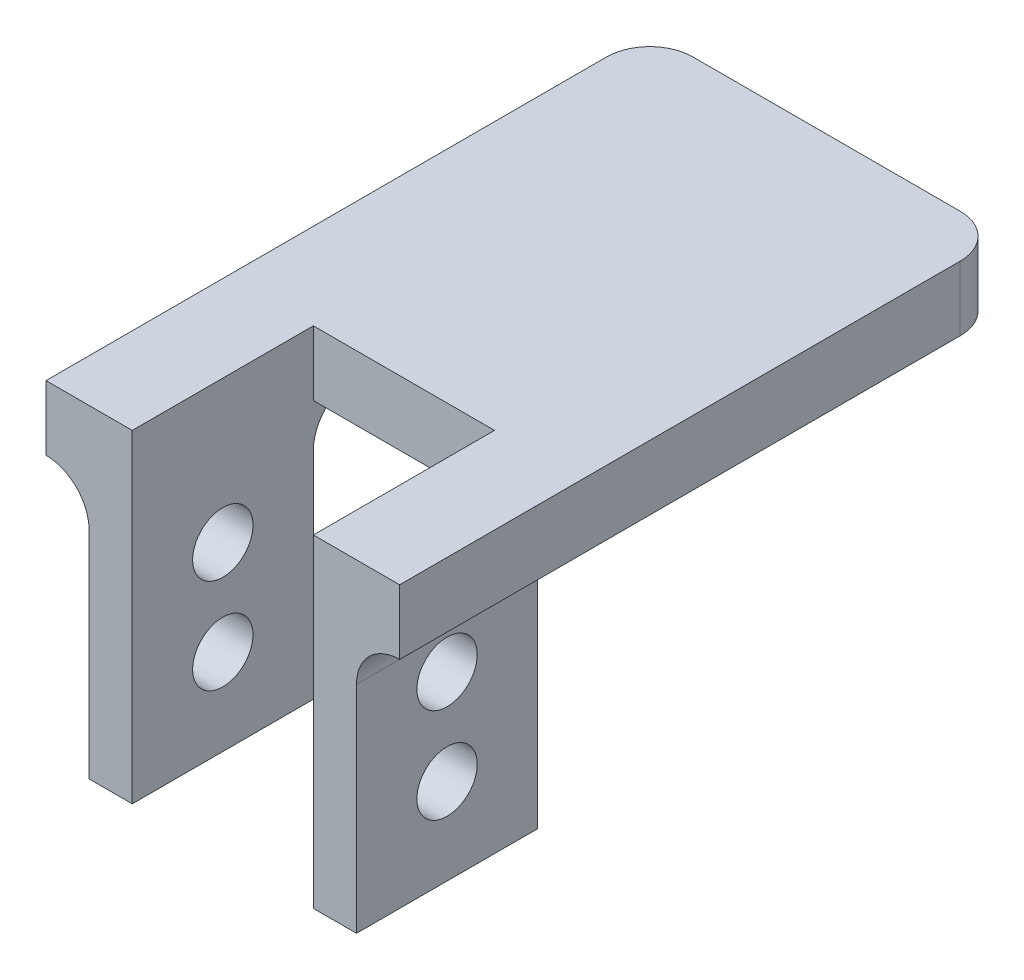
ISO-10303-21;
HEADER;
FILE_DESCRIPTION(('STEP AP214'),'2;1');
FILE_NAME('part.step','',(''),(''),'','','');
FILE_SCHEMA(('AUTOMOTIVE_DESIGN { 1 0 10303 214 1 1 1 1 }'));
ENDSEC;
DATA;
#1=APPLICATION_CONTEXT('core data for automotive mechanical design processes');
#2=APPLICATION_PROTOCOL_DEFINITION('international standard','automotive_design',2000,#1);
#3=PRODUCT_CONTEXT('',#1,'mechanical');
#4=PRODUCT('Part','Part','',(#3));
#5=PRODUCT_RELATED_PRODUCT_CATEGORY('part','',(#4));
#6=PRODUCT_DEFINITION_FORMATION('','',#4);
#7=PRODUCT_DEFINITION_CONTEXT('part definition',#1,'design');
#8=PRODUCT_DEFINITION('design','',#6,#7);
#9=PRODUCT_DEFINITION_SHAPE('','',#8);
#10=(LENGTH_UNIT() NAMED_UNIT(*) SI_UNIT(.MILLI.,.METRE.));
#11=(NAMED_UNIT(*) PLANE_ANGLE_UNIT() SI_UNIT($,.RADIAN.));
#12=(NAMED_UNIT(*) SI_UNIT($,.STERADIAN.) SOLID_ANGLE_UNIT());
#13=UNCERTAINTY_MEASURE_WITH_UNIT(LENGTH_MEASURE(1.E-05),#10,'distance_accuracy_value','');
#14=(GEOMETRIC_REPRESENTATION_CONTEXT(3) GLOBAL_UNCERTAINTY_ASSIGNED_CONTEXT((#13)) GLOBAL_UNIT_ASSIGNED_CONTEXT((#10,
#11,#12)) REPRESENTATION_CONTEXT('',''));
#15=CARTESIAN_POINT('',(0.,0.,0.));
#16=DIRECTION('',(0.,0.,1.));
#17=DIRECTION('',(1.,0.,0.));
#18=AXIS2_PLACEMENT_3D('',#15,#16,#17);
#19=CARTESIAN_POINT('',(0.,0.,0.));
#20=DIRECTION('',(0.,1.,0.));
#21=DIRECTION('',(0.,0.,1.));
#22=AXIS2_PLACEMENT_3D('',#19,#20,#21);
#23=PLANE('',#22);
#24=DIRECTION('',(0.,0.,1.));
#25=VECTOR('',#24,1.);
#26=CARTESIAN_POINT('',(-20.5,0.,-59.5));
#27=LINE('',#26,#25);
#28=CARTESIAN_POINT('',(-20.5,0.,-54.5));
#29=VERTEX_POINT('',#28);
#30=CARTESIAN_POINT('',(-20.5,0.,-15.5));
#31=VERTEX_POINT('',#30);
#32=EDGE_CURVE('E206',#29,#31,#27,.T.);
#33=ORIENTED_EDGE('',*,*,#32,.F.);
#34=CARTESIAN_POINT('',(-15.5,0.,-54.5));
#35=DIRECTION('',(0.,1.,0.));
#36=DIRECTION('',(0.,0.,1.));
#37=AXIS2_PLACEMENT_3D('',#34,#35,#36);
#38=CIRCLE('',#37,5.);
#39=CARTESIAN_POINT('',(-15.5,0.,-59.5));
#40=VERTEX_POINT('',#39);
#41=EDGE_CURVE('E327',#29,#40,#38,.F.);
#42=ORIENTED_EDGE('',*,*,#41,.T.);
#43=DIRECTION('',(-1.,0.,0.));
#44=VECTOR('',#43,1.);
#45=CARTESIAN_POINT('',(20.5,0.,-59.5));
#46=LINE('',#45,#44);
#47=CARTESIAN_POINT('',(15.5,0.,-59.5));
#48=VERTEX_POINT('',#47);
#49=EDGE_CURVE('E241',#48,#40,#46,.T.);
#50=ORIENTED_EDGE('',*,*,#49,.F.);
#51=CARTESIAN_POINT('',(15.5,0.,-54.5));
#52=DIRECTION('',(0.,1.,0.));
#53=DIRECTION('',(0.,0.,1.));
#54=AXIS2_PLACEMENT_3D('',#51,#52,#53);
#55=CIRCLE('',#54,5.);
#56=CARTESIAN_POINT('',(20.5,0.,-54.5));
#57=VERTEX_POINT('',#56);
#58=EDGE_CURVE('E324',#48,#57,#55,.F.);
#59=ORIENTED_EDGE('',*,*,#58,.T.);
#60=DIRECTION('',(0.,0.,-1.));
#61=VECTOR('',#60,1.);
#62=CARTESIAN_POINT('',(20.5,0.,10.5));
#63=LINE('',#62,#61);
#64=CARTESIAN_POINT('',(20.5,0.,-15.5));
#65=VERTEX_POINT('',#64);
#66=EDGE_CURVE('E269',#65,#57,#63,.T.);
#67=ORIENTED_EDGE('',*,*,#66,.F.);
#68=DIRECTION('',(1.,0.,0.));
#69=VECTOR('',#68,1.);
#70=CARTESIAN_POINT('',(10.5,0.,-15.5));
#71=LINE('',#70,#69);
#72=CARTESIAN_POINT('',(10.5,0.,-15.5));
#73=VERTEX_POINT('',#72);
#74=EDGE_CURVE('E315',#65,#73,#71,.F.);
#75=ORIENTED_EDGE('',*,*,#74,.T.);
#76=DIRECTION('',(0.,0.,1.));
#77=VECTOR('',#76,1.);
#78=CARTESIAN_POINT('',(10.5,0.,-10.5));
#79=LINE('',#78,#77);
#80=CARTESIAN_POINT('',(10.5,0.,-10.5));
#81=VERTEX_POINT('',#80);
#82=EDGE_CURVE('E312',#73,#81,#79,.T.);
#83=ORIENTED_EDGE('',*,*,#82,.T.);
#84=DIRECTION('',(1.,0.,0.));
#85=VECTOR('',#84,1.);
#86=CARTESIAN_POINT('',(-10.5,0.,-10.5));
#87=LINE('',#86,#85);
#88=CARTESIAN_POINT('',(-10.5,0.,-10.5));
#89=VERTEX_POINT('',#88);
#90=EDGE_CURVE('E265',#89,#81,#87,.T.);
#91=ORIENTED_EDGE('',*,*,#90,.F.);
#92=DIRECTION('',(0.,0.,-1.));
#93=VECTOR('',#92,1.);
#94=CARTESIAN_POINT('',(-10.5,0.,10.5));
#95=LINE('',#94,#93);
#96=CARTESIAN_POINT('',(-10.5,0.,-15.5));
#97=VERTEX_POINT('',#96);
#98=EDGE_CURVE('E63',#89,#97,#95,.T.);
#99=ORIENTED_EDGE('',*,*,#98,.T.);
#100=DIRECTION('',(1.,0.,0.));
#101=VECTOR('',#100,1.);
#102=CARTESIAN_POINT('',(-15.5,0.,-15.5));
#103=LINE('',#102,#101);
#104=EDGE_CURVE('E319',#97,#31,#103,.F.);
#105=ORIENTED_EDGE('',*,*,#104,.T.);
#106=EDGE_LOOP('',(#33,#42,#50,#59,#67,#75,#83,#91,#99,#105));
#107=FACE_BOUND('',#106,.T.);
#108=ADVANCED_FACE('F45',(#107),#23,.F.);
#109=CARTESIAN_POINT('',(-20.5,7.5,-59.5));
#110=DIRECTION('',(1.,0.,0.));
#111=DIRECTION('',(0.,0.,-1.));
#112=AXIS2_PLACEMENT_3D('',#109,#110,#111);
#113=PLANE('',#112);
#114=DIRECTION('',(0.,0.,1.));
#115=VECTOR('',#114,1.);
#116=CARTESIAN_POINT('',(-20.5,7.5,-59.5));
#117=LINE('',#116,#115);
#118=CARTESIAN_POINT('',(-20.5,7.5,-54.5));
#119=VERTEX_POINT('',#118);
#120=CARTESIAN_POINT('',(-20.5,7.5,10.5));
#121=VERTEX_POINT('',#120);
#122=EDGE_CURVE('E237',#119,#121,#117,.T.);
#123=ORIENTED_EDGE('',*,*,#122,.F.);
#124=DIRECTION('',(0.,-1.,0.));
#125=VECTOR('',#124,1.);
#126=CARTESIAN_POINT('',(-20.5,7.5,-54.5));
#127=LINE('',#126,#125);
#128=EDGE_CURVE('E334',#119,#29,#127,.T.);
#129=ORIENTED_EDGE('',*,*,#128,.T.);
#130=ORIENTED_EDGE('',*,*,#32,.T.);
#131=CARTESIAN_POINT('',(-20.5,0.,10.5));
#132=VERTEX_POINT('',#131);
#133=EDGE_CURVE('E202',#31,#132,#27,.T.);
#134=ORIENTED_EDGE('',*,*,#133,.T.);
#135=DIRECTION('',(0.,-1.,0.));
#136=VECTOR('',#135,1.);
#137=CARTESIAN_POINT('',(-20.5,7.5,10.5));
#138=LINE('',#137,#136);
#139=EDGE_CURVE('E294',#121,#132,#138,.T.);
#140=ORIENTED_EDGE('',*,*,#139,.F.);
#141=EDGE_LOOP('',(#123,#129,#130,#134,#140));
#142=FACE_BOUND('',#141,.T.);
#143=ADVANCED_FACE('F423',(#142),#113,.F.);
#144=CARTESIAN_POINT('',(-20.5,7.5,10.5));
#145=DIRECTION('',(0.,0.,-1.));
#146=DIRECTION('',(-1.,0.,0.));
#147=AXIS2_PLACEMENT_3D('',#144,#145,#146);
#148=PLANE('',#147);
#149=ORIENTED_EDGE('',*,*,#139,.T.);
#150=CARTESIAN_POINT('',(-20.5,-5.,10.5));
#151=DIRECTION('',(0.,0.,-1.));
#152=DIRECTION('',(-1.,0.,0.));
#153=AXIS2_PLACEMENT_3D('',#150,#151,#152);
#154=CIRCLE('',#153,5.);
#155=CARTESIAN_POINT('',(-15.5,-5.,10.5));
#156=VERTEX_POINT('',#155);
#157=EDGE_CURVE('E360',#132,#156,#154,.T.);
#158=ORIENTED_EDGE('',*,*,#157,.T.);
#159=DIRECTION('',(0.,1.,0.));
#160=VECTOR('',#159,1.);
#161=CARTESIAN_POINT('',(-15.5,-30.,10.5));
#162=LINE('',#161,#160);
#163=CARTESIAN_POINT('',(-15.5,-30.,10.5));
#164=VERTEX_POINT('',#163);
#165=EDGE_CURVE('E208',#164,#156,#162,.T.);
#166=ORIENTED_EDGE('',*,*,#165,.F.);
#167=DIRECTION('',(-1.,0.,0.));
#168=VECTOR('',#167,1.);
#169=CARTESIAN_POINT('',(-15.5,-30.,10.5));
#170=LINE('',#169,#168);
#171=CARTESIAN_POINT('',(-10.5,-30.,10.5));
#172=VERTEX_POINT('',#171);
#173=EDGE_CURVE('E190',#172,#164,#170,.T.);
#174=ORIENTED_EDGE('',*,*,#173,.F.);
#175=DIRECTION('',(0.,-1.,0.));
#176=VECTOR('',#175,1.);
#177=CARTESIAN_POINT('',(-10.5,7.5,10.5));
#178=LINE('',#177,#176);
#179=CARTESIAN_POINT('',(-10.5,7.5,10.5));
#180=VERTEX_POINT('',#179);
#181=EDGE_CURVE('E291',#180,#172,#178,.T.);
#182=ORIENTED_EDGE('',*,*,#181,.F.);
#183=DIRECTION('',(1.,0.,0.));
#184=VECTOR('',#183,1.);
#185=CARTESIAN_POINT('',(-20.5,7.5,10.5));
#186=LINE('',#185,#184);
#187=EDGE_CURVE('E240',#121,#180,#186,.T.);
#188=ORIENTED_EDGE('',*,*,#187,.F.);
#189=EDGE_LOOP('',(#149,#158,#166,#174,#182,#188));
#190=FACE_BOUND('',#189,.T.);
#191=ADVANCED_FACE('F429',(#190),#148,.F.);
#192=CARTESIAN_POINT('',(-10.5,7.5,10.5));
#193=DIRECTION('',(-1.,0.,0.));
#194=DIRECTION('',(0.,0.,1.));
#195=AXIS2_PLACEMENT_3D('',#192,#193,#194);
#196=PLANE('',#195);
#197=CARTESIAN_POINT('',(-10.5,-8.99999999999999,0.));
#198=DIRECTION('',(-1.,0.,0.));
#199=DIRECTION('',(0.,0.,1.));
#200=AXIS2_PLACEMENT_3D('',#197,#198,#199);
#201=CIRCLE('',#200,3.5);
#202=CARTESIAN_POINT('',(-10.5,-8.99999999999999,3.5));
#203=VERTEX_POINT('',#202);
#204=EDGE_CURVE('E217',#203,#203,#201,.T.);
#205=ORIENTED_EDGE('',*,*,#204,.T.);
#206=EDGE_LOOP('',(#205));
#207=FACE_BOUND('',#206,.T.);
#208=CARTESIAN_POINT('',(-10.5,-20.,0.));
#209=DIRECTION('',(-1.,0.,0.));
#210=DIRECTION('',(0.,0.,1.));
#211=AXIS2_PLACEMENT_3D('',#208,#209,#210);
#212=CIRCLE('',#211,3.5);
#213=CARTESIAN_POINT('',(-10.5,-20.,3.5));
#214=VERTEX_POINT('',#213);
#215=EDGE_CURVE('E309',#214,#214,#212,.T.);
#216=ORIENTED_EDGE('',*,*,#215,.T.);
#217=EDGE_LOOP('',(#216));
#218=FACE_BOUND('',#217,.T.);
#219=ORIENTED_EDGE('',*,*,#181,.T.);
#220=DIRECTION('',(0.,0.,1.));
#221=VECTOR('',#220,1.);
#222=CARTESIAN_POINT('',(-10.5,-30.,10.5));
#223=LINE('',#222,#221);
#224=CARTESIAN_POINT('',(-10.5,-30.,-10.5));
#225=VERTEX_POINT('',#224);
#226=EDGE_CURVE('E184',#225,#172,#223,.T.);
#227=ORIENTED_EDGE('',*,*,#226,.F.);
#228=DIRECTION('',(0.,1.,0.));
#229=VECTOR('',#228,1.);
#230=CARTESIAN_POINT('',(-10.5,-30.,-10.5));
#231=LINE('',#230,#229);
#232=CARTESIAN_POINT('',(-10.5,-5.,-10.5));
#233=VERTEX_POINT('',#232);
#234=EDGE_CURVE('E179',#225,#233,#231,.T.);
#235=ORIENTED_EDGE('',*,*,#234,.T.);
#236=CARTESIAN_POINT('',(-10.5,-5.,-15.5));
#237=DIRECTION('',(-1.,0.,0.));
#238=DIRECTION('',(0.,0.,1.));
#239=AXIS2_PLACEMENT_3D('',#236,#237,#238);
#240=CIRCLE('',#239,5.);
#241=EDGE_CURVE('E55',#233,#97,#240,.T.);
#242=ORIENTED_EDGE('',*,*,#241,.T.);
#243=ORIENTED_EDGE('',*,*,#98,.F.);
#244=DIRECTION('',(0.,-1.,0.));
#245=VECTOR('',#244,1.);
#246=CARTESIAN_POINT('',(-10.5,7.5,-10.5));
#247=LINE('',#246,#245);
#248=CARTESIAN_POINT('',(-10.5,7.5,-10.5));
#249=VERTEX_POINT('',#248);
#250=EDGE_CURVE('E287',#249,#89,#247,.T.);
#251=ORIENTED_EDGE('',*,*,#250,.F.);
#252=DIRECTION('',(0.,0.,-1.));
#253=VECTOR('',#252,1.);
#254=CARTESIAN_POINT('',(-10.5,7.5,10.5));
#255=LINE('',#254,#253);
#256=EDGE_CURVE('E244',#180,#249,#255,.T.);
#257=ORIENTED_EDGE('',*,*,#256,.F.);
#258=EDGE_LOOP('',(#219,#227,#235,#242,#243,#251,#257));
#259=FACE_BOUND('',#258,.T.);
#260=ADVANCED_FACE('F447',(#207,#218,#259),#196,.F.);
#261=CARTESIAN_POINT('',(-10.5,7.5,-10.5));
#262=DIRECTION('',(0.,0.,-1.));
#263=DIRECTION('',(-1.,0.,0.));
#264=AXIS2_PLACEMENT_3D('',#261,#262,#263);
#265=PLANE('',#264);
#266=ORIENTED_EDGE('',*,*,#90,.T.);
#267=DIRECTION('',(0.,-1.,0.));
#268=VECTOR('',#267,1.);
#269=CARTESIAN_POINT('',(10.5,7.5,-10.5));
#270=LINE('',#269,#268);
#271=CARTESIAN_POINT('',(10.5,7.5,-10.5));
#272=VERTEX_POINT('',#271);
#273=EDGE_CURVE('E283',#272,#81,#270,.T.);
#274=ORIENTED_EDGE('',*,*,#273,.F.);
#275=DIRECTION('',(1.,0.,0.));
#276=VECTOR('',#275,1.);
#277=CARTESIAN_POINT('',(-10.5,7.5,-10.5));
#278=LINE('',#277,#276);
#279=EDGE_CURVE('E247',#249,#272,#278,.T.);
#280=ORIENTED_EDGE('',*,*,#279,.F.);
#281=ORIENTED_EDGE('',*,*,#250,.T.);
#282=EDGE_LOOP('',(#266,#274,#280,#281));
#283=FACE_BOUND('',#282,.T.);
#284=ADVANCED_FACE('F444',(#283),#265,.F.);
#285=CARTESIAN_POINT('',(10.5,7.5,-10.5));
#286=DIRECTION('',(1.,0.,0.));
#287=DIRECTION('',(0.,0.,-1.));
#288=AXIS2_PLACEMENT_3D('',#285,#286,#287);
#289=PLANE('',#288);
#290=CARTESIAN_POINT('',(10.5,-8.99999999999999,0.));
#291=DIRECTION('',(1.,0.,0.));
#292=DIRECTION('',(0.,0.,-1.));
#293=AXIS2_PLACEMENT_3D('',#290,#291,#292);
#294=CIRCLE('',#293,3.5);
#295=CARTESIAN_POINT('',(10.5,-8.99999999999999,-3.5));
#296=VERTEX_POINT('',#295);
#297=EDGE_CURVE('E501',#296,#296,#294,.T.);
#298=ORIENTED_EDGE('',*,*,#297,.T.);
#299=EDGE_LOOP('',(#298));
#300=FACE_BOUND('',#299,.T.);
#301=CARTESIAN_POINT('',(10.5,-20.,0.));
#302=DIRECTION('',(1.,0.,0.));
#303=DIRECTION('',(0.,0.,-1.));
#304=AXIS2_PLACEMENT_3D('',#301,#302,#303);
#305=CIRCLE('',#304,3.5);
#306=CARTESIAN_POINT('',(10.5,-20.,-3.5));
#307=VERTEX_POINT('',#306);
#308=EDGE_CURVE('E511',#307,#307,#305,.T.);
#309=ORIENTED_EDGE('',*,*,#308,.T.);
#310=EDGE_LOOP('',(#309));
#311=FACE_BOUND('',#310,.T.);
#312=ORIENTED_EDGE('',*,*,#273,.T.);
#313=ORIENTED_EDGE('',*,*,#82,.F.);
#314=CARTESIAN_POINT('',(10.5,-5.,-15.5));
#315=DIRECTION('',(1.,0.,0.));
#316=DIRECTION('',(0.,0.,-1.));
#317=AXIS2_PLACEMENT_3D('',#314,#315,#316);
#318=CIRCLE('',#317,5.);
#319=CARTESIAN_POINT('',(10.5,-5.,-10.5));
#320=VERTEX_POINT('',#319);
#321=EDGE_CURVE('E11',#73,#320,#318,.T.);
#322=ORIENTED_EDGE('',*,*,#321,.T.);
#323=DIRECTION('',(0.,1.,0.));
#324=VECTOR('',#323,1.);
#325=CARTESIAN_POINT('',(10.5,-30.,-10.5));
#326=LINE('',#325,#324);
#327=CARTESIAN_POINT('',(10.5,-30.,-10.5));
#328=VERTEX_POINT('',#327);
#329=EDGE_CURVE('E216',#328,#320,#326,.T.);
#330=ORIENTED_EDGE('',*,*,#329,.F.);
#331=DIRECTION('',(0.,0.,-1.));
#332=VECTOR('',#331,1.);
#333=CARTESIAN_POINT('',(10.5,-30.,10.5));
#334=LINE('',#333,#332);
#335=CARTESIAN_POINT('',(10.5,-30.,10.5));
#336=VERTEX_POINT('',#335);
#337=EDGE_CURVE('E227',#336,#328,#334,.T.);
#338=ORIENTED_EDGE('',*,*,#337,.F.);
#339=DIRECTION('',(0.,-1.,0.));
#340=VECTOR('',#339,1.);
#341=CARTESIAN_POINT('',(10.5,7.5,10.5));
#342=LINE('',#341,#340);
#343=CARTESIAN_POINT('',(10.5,7.5,10.5));
#344=VERTEX_POINT('',#343);
#345=EDGE_CURVE('E280',#344,#336,#342,.T.);
#346=ORIENTED_EDGE('',*,*,#345,.F.);
#347=DIRECTION('',(0.,0.,1.));
#348=VECTOR('',#347,1.);
#349=CARTESIAN_POINT('',(10.5,7.5,-10.5));
#350=LINE('',#349,#348);
#351=EDGE_CURVE('E250',#272,#344,#350,.T.);
#352=ORIENTED_EDGE('',*,*,#351,.F.);
#353=EDGE_LOOP('',(#312,#313,#322,#330,#338,#346,#352));
#354=FACE_BOUND('',#353,.T.);
#355=ADVANCED_FACE('F405',(#300,#311,#354),#289,.F.);
#356=CARTESIAN_POINT('',(10.5,7.5,10.5));
#357=DIRECTION('',(0.,0.,-1.));
#358=DIRECTION('',(-1.,0.,0.));
#359=AXIS2_PLACEMENT_3D('',#356,#357,#358);
#360=PLANE('',#359);
#361=ORIENTED_EDGE('',*,*,#345,.T.);
#362=DIRECTION('',(-1.,0.,0.));
#363=VECTOR('',#362,1.);
#364=CARTESIAN_POINT('',(15.5,-30.,10.5));
#365=LINE('',#364,#363);
#366=CARTESIAN_POINT('',(15.5,-30.,10.5));
#367=VERTEX_POINT('',#366);
#368=EDGE_CURVE('E230',#367,#336,#365,.T.);
#369=ORIENTED_EDGE('',*,*,#368,.F.);
#370=DIRECTION('',(0.,1.,0.));
#371=VECTOR('',#370,1.);
#372=CARTESIAN_POINT('',(15.5,-30.,10.5));
#373=LINE('',#372,#371);
#374=CARTESIAN_POINT('',(15.5,-5.,10.5));
#375=VERTEX_POINT('',#374);
#376=EDGE_CURVE('E212',#367,#375,#373,.T.);
#377=ORIENTED_EDGE('',*,*,#376,.T.);
#378=CARTESIAN_POINT('',(20.5,-5.,10.5));
#379=DIRECTION('',(0.,0.,-1.));
#380=DIRECTION('',(-1.,0.,0.));
#381=AXIS2_PLACEMENT_3D('',#378,#379,#380);
#382=CIRCLE('',#381,5.);
#383=CARTESIAN_POINT('',(20.5,0.,10.5));
#384=VERTEX_POINT('',#383);
#385=EDGE_CURVE('E363',#375,#384,#382,.T.);
#386=ORIENTED_EDGE('',*,*,#385,.T.);
#387=DIRECTION('',(0.,-1.,0.));
#388=VECTOR('',#387,1.);
#389=CARTESIAN_POINT('',(20.5,7.5,10.5));
#390=LINE('',#389,#388);
#391=CARTESIAN_POINT('',(20.5,7.5,10.5));
#392=VERTEX_POINT('',#391);
#393=EDGE_CURVE('E263',#392,#384,#390,.T.);
#394=ORIENTED_EDGE('',*,*,#393,.F.);
#395=DIRECTION('',(1.,0.,0.));
#396=VECTOR('',#395,1.);
#397=CARTESIAN_POINT('',(10.5,7.5,10.5));
#398=LINE('',#397,#396);
#399=EDGE_CURVE('E253',#344,#392,#398,.T.);
#400=ORIENTED_EDGE('',*,*,#399,.F.);
#401=EDGE_LOOP('',(#361,#369,#377,#386,#394,#400));
#402=FACE_BOUND('',#401,.T.);
#403=ADVANCED_FACE('F395',(#402),#360,.F.);
#404=CARTESIAN_POINT('',(20.5,7.5,10.5));
#405=DIRECTION('',(-1.,0.,0.));
#406=DIRECTION('',(0.,0.,1.));
#407=AXIS2_PLACEMENT_3D('',#404,#405,#406);
#408=PLANE('',#407);
#409=ORIENTED_EDGE('',*,*,#66,.T.);
#410=DIRECTION('',(0.,-1.,0.));
#411=VECTOR('',#410,1.);
#412=CARTESIAN_POINT('',(20.5,7.5,-54.5));
#413=LINE('',#412,#411);
#414=CARTESIAN_POINT('',(20.5,7.5,-54.5));
#415=VERTEX_POINT('',#414);
#416=EDGE_CURVE('E351',#57,#415,#413,.F.);
#417=ORIENTED_EDGE('',*,*,#416,.T.);
#418=DIRECTION('',(0.,0.,-1.));
#419=VECTOR('',#418,1.);
#420=CARTESIAN_POINT('',(20.5,7.5,10.5));
#421=LINE('',#420,#419);
#422=EDGE_CURVE('E256',#392,#415,#421,.T.);
#423=ORIENTED_EDGE('',*,*,#422,.F.);
#424=ORIENTED_EDGE('',*,*,#393,.T.);
#425=EDGE_CURVE('E270',#384,#65,#63,.T.);
#426=ORIENTED_EDGE('',*,*,#425,.T.);
#427=EDGE_LOOP('',(#409,#417,#423,#424,#426));
#428=FACE_BOUND('',#427,.T.);
#429=ADVANCED_FACE('F390',(#428),#408,.F.);
#430=CARTESIAN_POINT('',(20.5,7.5,-59.5));
#431=DIRECTION('',(0.,0.,1.));
#432=DIRECTION('',(1.,0.,0.));
#433=AXIS2_PLACEMENT_3D('',#430,#431,#432);
#434=PLANE('',#433);
#435=ORIENTED_EDGE('',*,*,#49,.T.);
#436=DIRECTION('',(0.,-1.,0.));
#437=VECTOR('',#436,1.);
#438=CARTESIAN_POINT('',(-15.5,7.5,-59.5));
#439=LINE('',#438,#437);
#440=CARTESIAN_POINT('',(-15.5,7.5,-59.5));
#441=VERTEX_POINT('',#440);
#442=EDGE_CURVE('E342',#40,#441,#439,.F.);
#443=ORIENTED_EDGE('',*,*,#442,.T.);
#444=DIRECTION('',(-1.,0.,0.));
#445=VECTOR('',#444,1.);
#446=CARTESIAN_POINT('',(20.5,7.5,-59.5));
#447=LINE('',#446,#445);
#448=CARTESIAN_POINT('',(15.5,7.5,-59.5));
#449=VERTEX_POINT('',#448);
#450=EDGE_CURVE('E260',#449,#441,#447,.T.);
#451=ORIENTED_EDGE('',*,*,#450,.F.);
#452=DIRECTION('',(0.,-1.,0.));
#453=VECTOR('',#452,1.);
#454=CARTESIAN_POINT('',(15.5,7.5,-59.5));
#455=LINE('',#454,#453);
#456=EDGE_CURVE('E338',#449,#48,#455,.T.);
#457=ORIENTED_EDGE('',*,*,#456,.T.);
#458=EDGE_LOOP('',(#435,#443,#451,#457));
#459=FACE_BOUND('',#458,.T.);
#460=ADVANCED_FACE('F434',(#459),#434,.F.);
#461=CARTESIAN_POINT('',(0.,7.5,0.));
#462=DIRECTION('',(0.,1.,0.));
#463=DIRECTION('',(0.,0.,1.));
#464=AXIS2_PLACEMENT_3D('',#461,#462,#463);
#465=PLANE('',#464);
#466=ORIENTED_EDGE('',*,*,#450,.T.);
#467=CARTESIAN_POINT('',(-15.5,7.5,-54.5));
#468=DIRECTION('',(0.,1.,0.));
#469=DIRECTION('',(0.,0.,1.));
#470=AXIS2_PLACEMENT_3D('',#467,#468,#469);
#471=CIRCLE('',#470,5.);
#472=EDGE_CURVE('E348',#441,#119,#471,.T.);
#473=ORIENTED_EDGE('',*,*,#472,.T.);
#474=ORIENTED_EDGE('',*,*,#122,.T.);
#475=ORIENTED_EDGE('',*,*,#187,.T.);
#476=ORIENTED_EDGE('',*,*,#256,.T.);
#477=ORIENTED_EDGE('',*,*,#279,.T.);
#478=ORIENTED_EDGE('',*,*,#351,.T.);
#479=ORIENTED_EDGE('',*,*,#399,.T.);
#480=ORIENTED_EDGE('',*,*,#422,.T.);
#481=CARTESIAN_POINT('',(15.5,7.5,-54.5));
#482=DIRECTION('',(0.,1.,0.));
#483=DIRECTION('',(0.,0.,1.));
#484=AXIS2_PLACEMENT_3D('',#481,#482,#483);
#485=CIRCLE('',#484,5.);
#486=EDGE_CURVE('E345',#415,#449,#485,.T.);
#487=ORIENTED_EDGE('',*,*,#486,.T.);
#488=EDGE_LOOP('',(#466,#473,#474,#475,#476,#477,#478,#479,#480,#487));
#489=FACE_BOUND('',#488,.T.);
#490=ADVANCED_FACE('F433',(#489),#465,.T.);
#491=CARTESIAN_POINT('',(15.5,-30.,10.5));
#492=DIRECTION('',(-1.,0.,0.));
#493=DIRECTION('',(0.,0.,1.));
#494=AXIS2_PLACEMENT_3D('',#491,#492,#493);
#495=PLANE('',#494);
#496=CARTESIAN_POINT('',(15.5,-8.99999999999999,0.));
#497=DIRECTION('',(-1.,0.,0.));
#498=DIRECTION('',(0.,0.,1.));
#499=AXIS2_PLACEMENT_3D('',#496,#497,#498);
#500=CIRCLE('',#499,3.5);
#501=CARTESIAN_POINT('',(15.5,-8.99999999999999,3.5));
#502=VERTEX_POINT('',#501);
#503=EDGE_CURVE('E308',#502,#502,#500,.T.);
#504=ORIENTED_EDGE('',*,*,#503,.T.);
#505=EDGE_LOOP('',(#504));
#506=FACE_BOUND('',#505,.T.);
#507=CARTESIAN_POINT('',(15.5,-20.,0.));
#508=DIRECTION('',(-1.,0.,0.));
#509=DIRECTION('',(0.,0.,1.));
#510=AXIS2_PLACEMENT_3D('',#507,#508,#509);
#511=CIRCLE('',#510,3.5);
#512=CARTESIAN_POINT('',(15.5,-20.,3.5));
#513=VERTEX_POINT('',#512);
#514=EDGE_CURVE('E302',#513,#513,#511,.T.);
#515=ORIENTED_EDGE('',*,*,#514,.T.);
#516=EDGE_LOOP('',(#515));
#517=FACE_BOUND('',#516,.T.);
#518=DIRECTION('',(0.,1.,0.));
#519=VECTOR('',#518,1.);
#520=CARTESIAN_POINT('',(15.5,-30.,-10.5));
#521=LINE('',#520,#519);
#522=CARTESIAN_POINT('',(15.5,-30.,-10.5));
#523=VERTEX_POINT('',#522);
#524=CARTESIAN_POINT('',(15.5,-5.,-10.5));
#525=VERTEX_POINT('',#524);
#526=EDGE_CURVE('E220',#523,#525,#521,.T.);
#527=ORIENTED_EDGE('',*,*,#526,.T.);
#528=DIRECTION('',(0.,0.,1.));
#529=VECTOR('',#528,1.);
#530=CARTESIAN_POINT('',(15.5,-5.,10.5));
#531=LINE('',#530,#529);
#532=EDGE_CURVE('E330',#525,#375,#531,.T.);
#533=ORIENTED_EDGE('',*,*,#532,.T.);
#534=ORIENTED_EDGE('',*,*,#376,.F.);
#535=DIRECTION('',(0.,0.,1.));
#536=VECTOR('',#535,1.);
#537=CARTESIAN_POINT('',(15.5,-30.,10.5));
#538=LINE('',#537,#536);
#539=EDGE_CURVE('E195',#523,#367,#538,.T.);
#540=ORIENTED_EDGE('',*,*,#539,.F.);
#541=EDGE_LOOP('',(#527,#533,#534,#540));
#542=FACE_BOUND('',#541,.T.);
#543=ADVANCED_FACE('F398',(#506,#517,#542),#495,.F.);
#544=CARTESIAN_POINT('',(15.5,-30.,-10.5));
#545=DIRECTION('',(0.,0.,1.));
#546=DIRECTION('',(1.,0.,0.));
#547=AXIS2_PLACEMENT_3D('',#544,#545,#546);
#548=PLANE('',#547);
#549=ORIENTED_EDGE('',*,*,#329,.T.);
#550=DIRECTION('',(1.,0.,0.));
#551=VECTOR('',#550,1.);
#552=CARTESIAN_POINT('',(15.5,-5.,-10.5));
#553=LINE('',#552,#551);
#554=EDGE_CURVE('E357',#320,#525,#553,.T.);
#555=ORIENTED_EDGE('',*,*,#554,.T.);
#556=ORIENTED_EDGE('',*,*,#526,.F.);
#557=DIRECTION('',(1.,0.,0.));
#558=VECTOR('',#557,1.);
#559=CARTESIAN_POINT('',(15.5,-30.,-10.5));
#560=LINE('',#559,#558);
#561=EDGE_CURVE('E224',#328,#523,#560,.T.);
#562=ORIENTED_EDGE('',*,*,#561,.F.);
#563=EDGE_LOOP('',(#549,#555,#556,#562));
#564=FACE_BOUND('',#563,.T.);
#565=ADVANCED_FACE('F403',(#564),#548,.F.);
#566=CARTESIAN_POINT('',(0.,-30.,0.));
#567=DIRECTION('',(0.,1.,0.));
#568=DIRECTION('',(0.,0.,1.));
#569=AXIS2_PLACEMENT_3D('',#566,#567,#568);
#570=PLANE('',#569);
#571=ORIENTED_EDGE('',*,*,#539,.T.);
#572=ORIENTED_EDGE('',*,*,#368,.T.);
#573=ORIENTED_EDGE('',*,*,#337,.T.);
#574=ORIENTED_EDGE('',*,*,#561,.T.);
#575=EDGE_LOOP('',(#571,#572,#573,#574));
#576=FACE_BOUND('',#575,.T.);
#577=ADVANCED_FACE('F409',(#576),#570,.F.);
#578=CARTESIAN_POINT('',(-15.5,-30.,10.5));
#579=DIRECTION('',(1.,0.,0.));
#580=DIRECTION('',(0.,0.,-1.));
#581=AXIS2_PLACEMENT_3D('',#578,#579,#580);
#582=PLANE('',#581);
#583=CARTESIAN_POINT('',(-15.5,-8.99999999999999,0.));
#584=DIRECTION('',(1.,0.,0.));
#585=DIRECTION('',(0.,0.,-1.));
#586=AXIS2_PLACEMENT_3D('',#583,#584,#585);
#587=CIRCLE('',#586,3.5);
#588=CARTESIAN_POINT('',(-15.5,-8.99999999999999,-3.5));
#589=VERTEX_POINT('',#588);
#590=EDGE_CURVE('E304',#589,#589,#587,.T.);
#591=ORIENTED_EDGE('',*,*,#590,.T.);
#592=EDGE_LOOP('',(#591));
#593=FACE_BOUND('',#592,.T.);
#594=CARTESIAN_POINT('',(-15.5,-20.,0.));
#595=DIRECTION('',(1.,0.,0.));
#596=DIRECTION('',(0.,0.,-1.));
#597=AXIS2_PLACEMENT_3D('',#594,#595,#596);
#598=CIRCLE('',#597,3.5);
#599=CARTESIAN_POINT('',(-15.5,-20.,-3.5));
#600=VERTEX_POINT('',#599);
#601=EDGE_CURVE('E298',#600,#600,#598,.T.);
#602=ORIENTED_EDGE('',*,*,#601,.T.);
#603=EDGE_LOOP('',(#602));
#604=FACE_BOUND('',#603,.T.);
#605=ORIENTED_EDGE('',*,*,#165,.T.);
#606=DIRECTION('',(0.,0.,-1.));
#607=VECTOR('',#606,1.);
#608=CARTESIAN_POINT('',(-15.5,-5.,-10.5));
#609=LINE('',#608,#607);
#610=CARTESIAN_POINT('',(-15.5,-5.,-10.5));
#611=VERTEX_POINT('',#610);
#612=EDGE_CURVE('E200',#156,#611,#609,.T.);
#613=ORIENTED_EDGE('',*,*,#612,.T.);
#614=DIRECTION('',(0.,1.,0.));
#615=VECTOR('',#614,1.);
#616=CARTESIAN_POINT('',(-15.5,-30.,-10.5));
#617=LINE('',#616,#615);
#618=CARTESIAN_POINT('',(-15.5,-30.,-10.5));
#619=VERTEX_POINT('',#618);
#620=EDGE_CURVE('E177',#619,#611,#617,.T.);
#621=ORIENTED_EDGE('',*,*,#620,.F.);
#622=DIRECTION('',(0.,0.,-1.));
#623=VECTOR('',#622,1.);
#624=CARTESIAN_POINT('',(-15.5,-30.,10.5));
#625=LINE('',#624,#623);
#626=EDGE_CURVE('E185',#164,#619,#625,.T.);
#627=ORIENTED_EDGE('',*,*,#626,.F.);
#628=EDGE_LOOP('',(#605,#613,#621,#627));
#629=FACE_BOUND('',#628,.T.);
#630=ADVANCED_FACE('F198',(#593,#604,#629),#582,.F.);
#631=CARTESIAN_POINT('',(-15.5,-30.,-10.5));
#632=DIRECTION('',(0.,0.,1.));
#633=DIRECTION('',(1.,0.,0.));
#634=AXIS2_PLACEMENT_3D('',#631,#632,#633);
#635=PLANE('',#634);
#636=ORIENTED_EDGE('',*,*,#620,.T.);
#637=DIRECTION('',(1.,0.,0.));
#638=VECTOR('',#637,1.);
#639=CARTESIAN_POINT('',(-10.5,-5.,-10.5));
#640=LINE('',#639,#638);
#641=EDGE_CURVE('E354',#611,#233,#640,.T.);
#642=ORIENTED_EDGE('',*,*,#641,.T.);
#643=ORIENTED_EDGE('',*,*,#234,.F.);
#644=DIRECTION('',(1.,0.,0.));
#645=VECTOR('',#644,1.);
#646=CARTESIAN_POINT('',(-15.5,-30.,-10.5));
#647=LINE('',#646,#645);
#648=EDGE_CURVE('E173',#619,#225,#647,.T.);
#649=ORIENTED_EDGE('',*,*,#648,.F.);
#650=EDGE_LOOP('',(#636,#642,#643,#649));
#651=FACE_BOUND('',#650,.T.);
#652=ADVANCED_FACE('F175',(#651),#635,.F.);
#653=CARTESIAN_POINT('',(0.,-30.,0.));
#654=DIRECTION('',(0.,-1.,0.));
#655=DIRECTION('',(0.,0.,-1.));
#656=AXIS2_PLACEMENT_3D('',#653,#654,#655);
#657=PLANE('',#656);
#658=ORIENTED_EDGE('',*,*,#626,.T.);
#659=ORIENTED_EDGE('',*,*,#648,.T.);
#660=ORIENTED_EDGE('',*,*,#226,.T.);
#661=ORIENTED_EDGE('',*,*,#173,.T.);
#662=EDGE_LOOP('',(#658,#659,#660,#661));
#663=FACE_BOUND('',#662,.T.);
#664=ADVANCED_FACE('F188',(#663),#657,.T.);
#665=CARTESIAN_POINT('',(-20.5,-20.,0.));
#666=DIRECTION('',(1.,0.,0.));
#667=DIRECTION('',(0.,0.,-1.));
#668=AXIS2_PLACEMENT_3D('',#665,#666,#667);
#669=CYLINDRICAL_SURFACE('',#668,3.5);
#670=ORIENTED_EDGE('',*,*,#601,.F.);
#671=EDGE_LOOP('',(#670));
#672=FACE_BOUND('',#671,.T.);
#673=ORIENTED_EDGE('',*,*,#215,.F.);
#674=EDGE_LOOP('',(#673));
#675=FACE_BOUND('',#674,.T.);
#676=ADVANCED_FACE('F525',(#672,#675),#669,.F.);
#677=CARTESIAN_POINT('',(-20.5,-8.99999999999999,0.));
#678=DIRECTION('',(1.,0.,0.));
#679=DIRECTION('',(0.,0.,-1.));
#680=AXIS2_PLACEMENT_3D('',#677,#678,#679);
#681=CYLINDRICAL_SURFACE('',#680,3.5);
#682=ORIENTED_EDGE('',*,*,#590,.F.);
#683=EDGE_LOOP('',(#682));
#684=FACE_BOUND('',#683,.T.);
#685=ORIENTED_EDGE('',*,*,#204,.F.);
#686=EDGE_LOOP('',(#685));
#687=FACE_BOUND('',#686,.T.);
#688=ADVANCED_FACE('F523',(#684,#687),#681,.F.);
#689=ORIENTED_EDGE('',*,*,#514,.F.);
#690=EDGE_LOOP('',(#689));
#691=FACE_BOUND('',#690,.T.);
#692=ORIENTED_EDGE('',*,*,#308,.F.);
#693=EDGE_LOOP('',(#692));
#694=FACE_BOUND('',#693,.T.);
#695=ADVANCED_FACE('F520',(#691,#694),#669,.F.);
#696=ORIENTED_EDGE('',*,*,#503,.F.);
#697=EDGE_LOOP('',(#696));
#698=FACE_BOUND('',#697,.T.);
#699=ORIENTED_EDGE('',*,*,#297,.F.);
#700=EDGE_LOOP('',(#699));
#701=FACE_BOUND('',#700,.T.);
#702=ADVANCED_FACE('F461',(#698,#701),#681,.F.);
#703=CARTESIAN_POINT('',(-15.5,-5.,-15.5));
#704=DIRECTION('',(-1.,0.,0.));
#705=DIRECTION('',(0.,0.,1.));
#706=AXIS2_PLACEMENT_3D('',#703,#704,#705);
#707=CYLINDRICAL_SURFACE('',#706,5.);
#708=ORIENTED_EDGE('',*,*,#241,.F.);
#709=ORIENTED_EDGE('',*,*,#641,.F.);
#710=CARTESIAN_POINT('',(-20.5,-5.,-15.5));
#711=DIRECTION('',(-0.707106781186548,0.,0.707106781186547));
#712=DIRECTION('',(-0.707106781186547,0.,-0.707106781186548));
#713=AXIS2_PLACEMENT_3D('',#710,#711,#712);
#714=ELLIPSE('',#713,7.07106781186547,5.);
#715=EDGE_CURVE('E303',#31,#611,#714,.F.);
#716=ORIENTED_EDGE('',*,*,#715,.F.);
#717=ORIENTED_EDGE('',*,*,#104,.F.);
#718=EDGE_LOOP('',(#708,#709,#716,#717));
#719=FACE_BOUND('',#718,.T.);
#720=ADVANCED_FACE('F458',(#719),#707,.F.);
#721=CARTESIAN_POINT('',(-20.5,-5.,10.5));
#722=DIRECTION('',(0.,0.,1.));
#723=DIRECTION('',(1.,0.,0.));
#724=AXIS2_PLACEMENT_3D('',#721,#722,#723);
#725=CYLINDRICAL_SURFACE('',#724,5.);
#726=ORIENTED_EDGE('',*,*,#157,.F.);
#727=ORIENTED_EDGE('',*,*,#133,.F.);
#728=ORIENTED_EDGE('',*,*,#715,.T.);
#729=ORIENTED_EDGE('',*,*,#612,.F.);
#730=EDGE_LOOP('',(#726,#727,#728,#729));
#731=FACE_BOUND('',#730,.T.);
#732=ADVANCED_FACE('F455',(#731),#725,.F.);
#733=CARTESIAN_POINT('',(15.5,-5.,-15.5));
#734=DIRECTION('',(-1.,0.,0.));
#735=DIRECTION('',(0.,0.,1.));
#736=AXIS2_PLACEMENT_3D('',#733,#734,#735);
#737=CYLINDRICAL_SURFACE('',#736,5.);
#738=ORIENTED_EDGE('',*,*,#321,.F.);
#739=ORIENTED_EDGE('',*,*,#74,.F.);
#740=CARTESIAN_POINT('',(20.5,-5.,-15.5));
#741=DIRECTION('',(-0.707106781186547,0.,-0.707106781186548));
#742=DIRECTION('',(-0.707106781186548,0.,0.707106781186547));
#743=AXIS2_PLACEMENT_3D('',#740,#741,#742);
#744=ELLIPSE('',#743,7.07106781186547,5.);
#745=EDGE_CURVE('E49',#525,#65,#744,.T.);
#746=ORIENTED_EDGE('',*,*,#745,.F.);
#747=ORIENTED_EDGE('',*,*,#554,.F.);
#748=EDGE_LOOP('',(#738,#739,#746,#747));
#749=FACE_BOUND('',#748,.T.);
#750=ADVANCED_FACE('F382',(#749),#737,.F.);
#751=CARTESIAN_POINT('',(20.5,-5.,10.5));
#752=DIRECTION('',(0.,0.,-1.));
#753=DIRECTION('',(-1.,0.,0.));
#754=AXIS2_PLACEMENT_3D('',#751,#752,#753);
#755=CYLINDRICAL_SURFACE('',#754,5.);
#756=ORIENTED_EDGE('',*,*,#745,.T.);
#757=ORIENTED_EDGE('',*,*,#425,.F.);
#758=ORIENTED_EDGE('',*,*,#385,.F.);
#759=ORIENTED_EDGE('',*,*,#532,.F.);
#760=EDGE_LOOP('',(#756,#757,#758,#759));
#761=FACE_BOUND('',#760,.T.);
#762=ADVANCED_FACE('F378',(#761),#755,.F.);
#763=CARTESIAN_POINT('',(-15.5,7.5,-54.5));
#764=DIRECTION('',(0.,-1.,0.));
#765=DIRECTION('',(0.,0.,-1.));
#766=AXIS2_PLACEMENT_3D('',#763,#764,#765);
#767=CYLINDRICAL_SURFACE('',#766,5.);
#768=ORIENTED_EDGE('',*,*,#472,.F.);
#769=ORIENTED_EDGE('',*,*,#442,.F.);
#770=ORIENTED_EDGE('',*,*,#41,.F.);
#771=ORIENTED_EDGE('',*,*,#128,.F.);
#772=EDGE_LOOP('',(#768,#769,#770,#771));
#773=FACE_BOUND('',#772,.T.);
#774=ADVANCED_FACE('F465',(#773),#767,.T.);
#775=CARTESIAN_POINT('',(15.5,7.5,-54.5));
#776=DIRECTION('',(0.,-1.,0.));
#777=DIRECTION('',(0.,0.,-1.));
#778=AXIS2_PLACEMENT_3D('',#775,#776,#777);
#779=CYLINDRICAL_SURFACE('',#778,5.);
#780=ORIENTED_EDGE('',*,*,#486,.F.);
#781=ORIENTED_EDGE('',*,*,#416,.F.);
#782=ORIENTED_EDGE('',*,*,#58,.F.);
#783=ORIENTED_EDGE('',*,*,#456,.F.);
#784=EDGE_LOOP('',(#780,#781,#782,#783));
#785=FACE_BOUND('',#784,.T.);
#786=ADVANCED_FACE('F47',(#785),#779,.T.);
#787=CLOSED_SHELL('',(#108,#143,#191,#260,#284,#355,#403,#429,#460,#490,#543,#565,#577,#630,
#652,#664,#676,#688,#695,#702,#720,#732,#750,#762,#774,#786));
#788=MANIFOLD_SOLID_BREP('B2',#787);
#789=ADVANCED_BREP_SHAPE_REPRESENTATION('',(#18,#788),#14);
#790=SHAPE_DEFINITION_REPRESENTATION(#9,#789);
ENDSEC;
END-ISO-10303-21;
